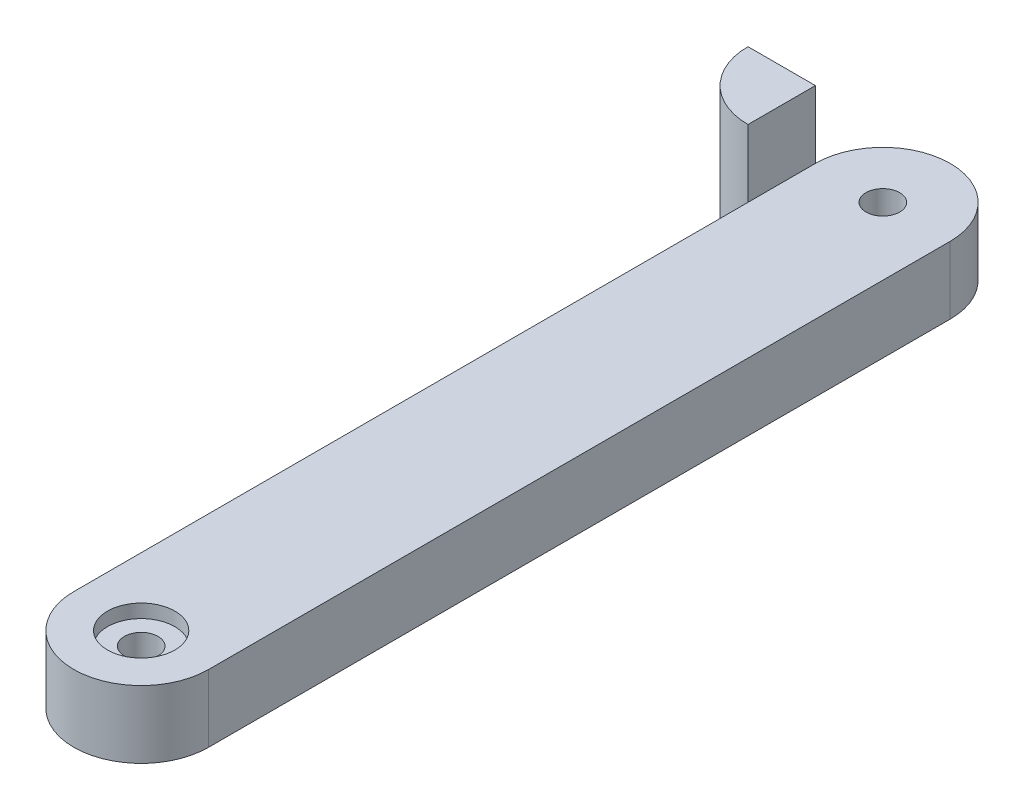
ISO-10303-21;
HEADER;
FILE_DESCRIPTION(('STEP AP214'),'2;1');
FILE_NAME('part.step','',(''),(''),'','','');
FILE_SCHEMA(('AUTOMOTIVE_DESIGN { 1 0 10303 214 1 1 1 1 }'));
ENDSEC;
DATA;
#1=APPLICATION_CONTEXT('core data for automotive mechanical design processes');
#2=APPLICATION_PROTOCOL_DEFINITION('international standard','automotive_design',2000,#1);
#3=PRODUCT_CONTEXT('',#1,'mechanical');
#4=PRODUCT('Part','Part','',(#3));
#5=PRODUCT_RELATED_PRODUCT_CATEGORY('part','',(#4));
#6=PRODUCT_DEFINITION_FORMATION('','',#4);
#7=PRODUCT_DEFINITION_CONTEXT('part definition',#1,'design');
#8=PRODUCT_DEFINITION('design','',#6,#7);
#9=PRODUCT_DEFINITION_SHAPE('','',#8);
#10=(LENGTH_UNIT() NAMED_UNIT(*) SI_UNIT(.MILLI.,.METRE.));
#11=(NAMED_UNIT(*) PLANE_ANGLE_UNIT() SI_UNIT($,.RADIAN.));
#12=(NAMED_UNIT(*) SI_UNIT($,.STERADIAN.) SOLID_ANGLE_UNIT());
#13=UNCERTAINTY_MEASURE_WITH_UNIT(LENGTH_MEASURE(1.E-05),#10,'distance_accuracy_value','');
#14=(GEOMETRIC_REPRESENTATION_CONTEXT(3) GLOBAL_UNCERTAINTY_ASSIGNED_CONTEXT((#13)) GLOBAL_UNIT_ASSIGNED_CONTEXT((#10,
#11,#12)) REPRESENTATION_CONTEXT('',''));
#15=CARTESIAN_POINT('',(0.,0.,0.));
#16=DIRECTION('',(0.,0.,1.));
#17=DIRECTION('',(1.,0.,0.));
#18=AXIS2_PLACEMENT_3D('',#15,#16,#17);
#19=CARTESIAN_POINT('',(0.,0.,-110.));
#20=DIRECTION('',(0.,1.,0.));
#21=DIRECTION('',(0.,0.,1.));
#22=AXIS2_PLACEMENT_3D('',#19,#20,#21);
#23=CYLINDRICAL_SURFACE('',#22,2.5);
#24=CARTESIAN_POINT('',(0.,10.,-110.));
#25=DIRECTION('',(0.,1.,0.));
#26=DIRECTION('',(0.,0.,1.));
#27=AXIS2_PLACEMENT_3D('',#24,#25,#26);
#28=CIRCLE('',#27,2.5);
#29=CARTESIAN_POINT('',(0.,10.,-107.5));
#30=VERTEX_POINT('',#29);
#31=EDGE_CURVE('E143',#30,#30,#28,.T.);
#32=ORIENTED_EDGE('',*,*,#31,.T.);
#33=EDGE_LOOP('',(#32));
#34=FACE_BOUND('',#33,.T.);
#35=CARTESIAN_POINT('',(0.,2.,-110.));
#36=DIRECTION('',(0.,-1.,0.));
#37=DIRECTION('',(0.,0.,-1.));
#38=AXIS2_PLACEMENT_3D('',#35,#36,#37);
#39=CIRCLE('',#38,2.5);
#40=CARTESIAN_POINT('',(0.,2.,-112.5));
#41=VERTEX_POINT('',#40);
#42=EDGE_CURVE('E39',#41,#41,#39,.F.);
#43=ORIENTED_EDGE('',*,*,#42,.F.);
#44=EDGE_LOOP('',(#43));
#45=FACE_BOUND('',#44,.T.);
#46=ADVANCED_FACE('F35',(#34,#45),#23,.F.);
#47=CARTESIAN_POINT('',(0.,0.,0.));
#48=DIRECTION('',(0.,1.,0.));
#49=DIRECTION('',(0.,0.,1.));
#50=AXIS2_PLACEMENT_3D('',#47,#48,#49);
#51=CYLINDRICAL_SURFACE('',#50,2.5);
#52=CARTESIAN_POINT('',(0.,0.,0.));
#53=DIRECTION('',(0.,1.,0.));
#54=DIRECTION('',(0.,0.,1.));
#55=AXIS2_PLACEMENT_3D('',#52,#53,#54);
#56=CIRCLE('',#55,2.5);
#57=CARTESIAN_POINT('',(0.,0.,2.5));
#58=VERTEX_POINT('',#57);
#59=EDGE_CURVE('E144',#58,#58,#56,.T.);
#60=ORIENTED_EDGE('',*,*,#59,.F.);
#61=EDGE_LOOP('',(#60));
#62=FACE_BOUND('',#61,.T.);
#63=CARTESIAN_POINT('',(0.,8.,0.));
#64=DIRECTION('',(0.,1.,0.));
#65=DIRECTION('',(0.,0.,1.));
#66=AXIS2_PLACEMENT_3D('',#63,#64,#65);
#67=CIRCLE('',#66,2.5);
#68=CARTESIAN_POINT('',(0.,8.,2.5));
#69=VERTEX_POINT('',#68);
#70=EDGE_CURVE('E115',#69,#69,#67,.F.);
#71=ORIENTED_EDGE('',*,*,#70,.F.);
#72=EDGE_LOOP('',(#71));
#73=FACE_BOUND('',#72,.T.);
#74=ADVANCED_FACE('F193',(#62,#73),#51,.F.);
#75=CARTESIAN_POINT('',(0.,10.,0.));
#76=DIRECTION('',(0.,1.,0.));
#77=DIRECTION('',(0.,0.,1.));
#78=AXIS2_PLACEMENT_3D('',#75,#76,#77);
#79=PLANE('',#78);
#80=CARTESIAN_POINT('',(0.,10.,0.));
#81=DIRECTION('',(0.,1.,0.));
#82=DIRECTION('',(0.,0.,1.));
#83=AXIS2_PLACEMENT_3D('',#80,#81,#82);
#84=CIRCLE('',#83,5.);
#85=CARTESIAN_POINT('',(0.,10.,5.));
#86=VERTEX_POINT('',#85);
#87=EDGE_CURVE('E173',#86,#86,#84,.T.);
#88=ORIENTED_EDGE('',*,*,#87,.F.);
#89=EDGE_LOOP('',(#88));
#90=FACE_BOUND('',#89,.T.);
#91=DIRECTION('',(0.,0.,-1.));
#92=VECTOR('',#91,1.);
#93=CARTESIAN_POINT('',(-9.99999999999999,10.,-110.));
#94=LINE('',#93,#92);
#95=CARTESIAN_POINT('',(-10.,10.,-100.));
#96=VERTEX_POINT('',#95);
#97=CARTESIAN_POINT('',(-9.99999999999999,10.,-110.));
#98=VERTEX_POINT('',#97);
#99=EDGE_CURVE('E114',#96,#98,#94,.T.);
#100=ORIENTED_EDGE('',*,*,#99,.F.);
#101=DIRECTION('',(0.,0.,-1.));
#102=VECTOR('',#101,1.);
#103=CARTESIAN_POINT('',(-10.,10.,0.));
#104=LINE('',#103,#102);
#105=CARTESIAN_POINT('',(-10.,10.,0.));
#106=VERTEX_POINT('',#105);
#107=EDGE_CURVE('E152',#106,#96,#104,.T.);
#108=ORIENTED_EDGE('',*,*,#107,.F.);
#109=CARTESIAN_POINT('',(0.,10.,0.));
#110=DIRECTION('',(0.,1.,0.));
#111=DIRECTION('',(0.,0.,1.));
#112=AXIS2_PLACEMENT_3D('',#109,#110,#111);
#113=CIRCLE('',#112,10.);
#114=CARTESIAN_POINT('',(10.,10.,0.));
#115=VERTEX_POINT('',#114);
#116=EDGE_CURVE('E154',#106,#115,#113,.T.);
#117=ORIENTED_EDGE('',*,*,#116,.T.);
#118=DIRECTION('',(0.,0.,-1.));
#119=VECTOR('',#118,1.);
#120=CARTESIAN_POINT('',(10.,10.,0.));
#121=LINE('',#120,#119);
#122=CARTESIAN_POINT('',(10.,10.,-110.));
#123=VERTEX_POINT('',#122);
#124=EDGE_CURVE('E54',#115,#123,#121,.T.);
#125=ORIENTED_EDGE('',*,*,#124,.T.);
#126=CARTESIAN_POINT('',(0.,10.,-110.));
#127=DIRECTION('',(0.,1.,0.));
#128=DIRECTION('',(0.,0.,1.));
#129=AXIS2_PLACEMENT_3D('',#126,#127,#128);
#130=CIRCLE('',#129,10.);
#131=EDGE_CURVE('E150',#123,#98,#130,.T.);
#132=ORIENTED_EDGE('',*,*,#131,.T.);
#133=EDGE_LOOP('',(#100,#108,#117,#125,#132));
#134=FACE_BOUND('',#133,.T.);
#135=ORIENTED_EDGE('',*,*,#31,.F.);
#136=EDGE_LOOP('',(#135));
#137=FACE_BOUND('',#136,.T.);
#138=ADVANCED_FACE('F199',(#90,#134,#137),#79,.T.);
#139=CARTESIAN_POINT('',(-10.,10.,0.));
#140=DIRECTION('',(-1.,0.,0.));
#141=DIRECTION('',(0.,0.,1.));
#142=AXIS2_PLACEMENT_3D('',#139,#140,#141);
#143=PLANE('',#142);
#144=ORIENTED_EDGE('',*,*,#107,.T.);
#145=DIRECTION('',(0.,1.,0.));
#146=VECTOR('',#145,1.);
#147=CARTESIAN_POINT('',(-10.,10.,-100.));
#148=LINE('',#147,#146);
#149=CARTESIAN_POINT('',(-10.,0.,-100.));
#150=VERTEX_POINT('',#149);
#151=EDGE_CURVE('E122',#150,#96,#148,.T.);
#152=ORIENTED_EDGE('',*,*,#151,.F.);
#153=DIRECTION('',(0.,0.,-1.));
#154=VECTOR('',#153,1.);
#155=CARTESIAN_POINT('',(-10.,0.,0.));
#156=LINE('',#155,#154);
#157=CARTESIAN_POINT('',(-10.,0.,0.));
#158=VERTEX_POINT('',#157);
#159=EDGE_CURVE('E160',#158,#150,#156,.T.);
#160=ORIENTED_EDGE('',*,*,#159,.F.);
#161=DIRECTION('',(0.,-1.,0.));
#162=VECTOR('',#161,1.);
#163=CARTESIAN_POINT('',(-10.,10.,0.));
#164=LINE('',#163,#162);
#165=EDGE_CURVE('E45',#106,#158,#164,.T.);
#166=ORIENTED_EDGE('',*,*,#165,.F.);
#167=EDGE_LOOP('',(#144,#152,#160,#166));
#168=FACE_BOUND('',#167,.T.);
#169=ADVANCED_FACE('F206',(#168),#143,.T.);
#170=CARTESIAN_POINT('',(0.,10.,-110.));
#171=DIRECTION('',(0.,-1.,0.));
#172=DIRECTION('',(0.,0.,-1.));
#173=AXIS2_PLACEMENT_3D('',#170,#171,#172);
#174=CYLINDRICAL_SURFACE('',#173,10.);
#175=CARTESIAN_POINT('',(0.,0.,-110.));
#176=DIRECTION('',(0.,1.,0.));
#177=DIRECTION('',(0.,0.,1.));
#178=AXIS2_PLACEMENT_3D('',#175,#176,#177);
#179=CIRCLE('',#178,10.);
#180=CARTESIAN_POINT('',(10.,0.,-110.));
#181=VERTEX_POINT('',#180);
#182=CARTESIAN_POINT('',(-10.,0.,-110.));
#183=VERTEX_POINT('',#182);
#184=EDGE_CURVE('E147',#181,#183,#179,.T.);
#185=ORIENTED_EDGE('',*,*,#184,.T.);
#186=DIRECTION('',(0.,-1.,0.));
#187=VECTOR('',#186,1.);
#188=CARTESIAN_POINT('',(-10.,10.,-110.));
#189=LINE('',#188,#187);
#190=EDGE_CURVE('E11',#98,#183,#189,.T.);
#191=ORIENTED_EDGE('',*,*,#190,.F.);
#192=ORIENTED_EDGE('',*,*,#131,.F.);
#193=DIRECTION('',(0.,-1.,0.));
#194=VECTOR('',#193,1.);
#195=CARTESIAN_POINT('',(10.,10.,-110.));
#196=LINE('',#195,#194);
#197=EDGE_CURVE('E157',#123,#181,#196,.T.);
#198=ORIENTED_EDGE('',*,*,#197,.T.);
#199=EDGE_LOOP('',(#185,#191,#192,#198));
#200=FACE_BOUND('',#199,.T.);
#201=ADVANCED_FACE('F37',(#200),#174,.T.);
#202=CARTESIAN_POINT('',(0.,10.,0.));
#203=DIRECTION('',(0.,-1.,0.));
#204=DIRECTION('',(0.,0.,-1.));
#205=AXIS2_PLACEMENT_3D('',#202,#203,#204);
#206=CYLINDRICAL_SURFACE('',#205,10.);
#207=CARTESIAN_POINT('',(0.,0.,0.));
#208=DIRECTION('',(0.,1.,0.));
#209=DIRECTION('',(0.,0.,1.));
#210=AXIS2_PLACEMENT_3D('',#207,#208,#209);
#211=CIRCLE('',#210,10.);
#212=CARTESIAN_POINT('',(10.,0.,0.));
#213=VERTEX_POINT('',#212);
#214=EDGE_CURVE('E71',#158,#213,#211,.T.);
#215=ORIENTED_EDGE('',*,*,#214,.T.);
#216=DIRECTION('',(0.,-1.,0.));
#217=VECTOR('',#216,1.);
#218=CARTESIAN_POINT('',(10.,10.,0.));
#219=LINE('',#218,#217);
#220=EDGE_CURVE('E166',#115,#213,#219,.T.);
#221=ORIENTED_EDGE('',*,*,#220,.F.);
#222=ORIENTED_EDGE('',*,*,#116,.F.);
#223=ORIENTED_EDGE('',*,*,#165,.T.);
#224=EDGE_LOOP('',(#215,#221,#222,#223));
#225=FACE_BOUND('',#224,.T.);
#226=ADVANCED_FACE('F215',(#225),#206,.T.);
#227=CARTESIAN_POINT('',(10.,10.,0.));
#228=DIRECTION('',(-1.,0.,0.));
#229=DIRECTION('',(0.,0.,1.));
#230=AXIS2_PLACEMENT_3D('',#227,#228,#229);
#231=PLANE('',#230);
#232=DIRECTION('',(0.,0.,-1.));
#233=VECTOR('',#232,1.);
#234=CARTESIAN_POINT('',(10.,0.,0.));
#235=LINE('',#234,#233);
#236=EDGE_CURVE('E76',#213,#181,#235,.T.);
#237=ORIENTED_EDGE('',*,*,#236,.T.);
#238=ORIENTED_EDGE('',*,*,#197,.F.);
#239=ORIENTED_EDGE('',*,*,#124,.F.);
#240=ORIENTED_EDGE('',*,*,#220,.T.);
#241=EDGE_LOOP('',(#237,#238,#239,#240));
#242=FACE_BOUND('',#241,.T.);
#243=ADVANCED_FACE('F211',(#242),#231,.F.);
#244=CARTESIAN_POINT('',(0.,0.,0.));
#245=DIRECTION('',(0.,1.,0.));
#246=DIRECTION('',(0.,0.,1.));
#247=AXIS2_PLACEMENT_3D('',#244,#245,#246);
#248=PLANE('',#247);
#249=CARTESIAN_POINT('',(0.,0.,-110.));
#250=DIRECTION('',(0.,-1.,0.));
#251=DIRECTION('',(0.,0.,-1.));
#252=AXIS2_PLACEMENT_3D('',#249,#250,#251);
#253=CIRCLE('',#252,5.);
#254=CARTESIAN_POINT('',(0.,0.,-115.));
#255=VERTEX_POINT('',#254);
#256=EDGE_CURVE('E180',#255,#255,#253,.T.);
#257=ORIENTED_EDGE('',*,*,#256,.F.);
#258=EDGE_LOOP('',(#257));
#259=FACE_BOUND('',#258,.T.);
#260=ORIENTED_EDGE('',*,*,#59,.T.);
#261=EDGE_LOOP('',(#260));
#262=FACE_BOUND('',#261,.T.);
#263=ORIENTED_EDGE('',*,*,#184,.F.);
#264=ORIENTED_EDGE('',*,*,#236,.F.);
#265=ORIENTED_EDGE('',*,*,#214,.F.);
#266=ORIENTED_EDGE('',*,*,#159,.T.);
#267=CARTESIAN_POINT('',(-10.,0.,-110.));
#268=DIRECTION('',(0.,1.,0.));
#269=DIRECTION('',(0.,0.,1.));
#270=AXIS2_PLACEMENT_3D('',#267,#268,#269);
#271=CIRCLE('',#270,9.99999999999999);
#272=CARTESIAN_POINT('',(-20.,0.,-110.));
#273=VERTEX_POINT('',#272);
#274=EDGE_CURVE('E141',#273,#150,#271,.T.);
#275=ORIENTED_EDGE('',*,*,#274,.F.);
#276=DIRECTION('',(-1.,0.,0.));
#277=VECTOR('',#276,1.);
#278=CARTESIAN_POINT('',(-9.99999999999999,0.,-110.));
#279=LINE('',#278,#277);
#280=EDGE_CURVE('E136',#183,#273,#279,.T.);
#281=ORIENTED_EDGE('',*,*,#280,.F.);
#282=EDGE_LOOP('',(#263,#264,#265,#266,#275,#281));
#283=FACE_BOUND('',#282,.T.);
#284=ADVANCED_FACE('F208',(#259,#262,#283),#248,.F.);
#285=CARTESIAN_POINT('',(-10.,10.,-110.));
#286=DIRECTION('',(0.,1.,0.));
#287=DIRECTION('',(0.,0.,1.));
#288=AXIS2_PLACEMENT_3D('',#285,#286,#287);
#289=CYLINDRICAL_SURFACE('',#288,9.99999999999999);
#290=ORIENTED_EDGE('',*,*,#151,.T.);
#291=DIRECTION('',(0.,-1.,0.));
#292=VECTOR('',#291,1.);
#293=CARTESIAN_POINT('',(-10.,20.,-100.));
#294=LINE('',#293,#292);
#295=CARTESIAN_POINT('',(-10.000000000001,20.,-100.));
#296=VERTEX_POINT('',#295);
#297=EDGE_CURVE('E119',#296,#96,#294,.T.);
#298=ORIENTED_EDGE('',*,*,#297,.F.);
#299=CARTESIAN_POINT('',(-10.0000000000011,20.,-110.));
#300=DIRECTION('',(0.,1.,0.));
#301=DIRECTION('',(0.,0.,1.));
#302=AXIS2_PLACEMENT_3D('',#299,#300,#301);
#303=CIRCLE('',#302,9.9999999999999);
#304=CARTESIAN_POINT('',(-20.000000000001,20.,-110.));
#305=VERTEX_POINT('',#304);
#306=EDGE_CURVE('E104',#305,#296,#303,.T.);
#307=ORIENTED_EDGE('',*,*,#306,.F.);
#308=DIRECTION('',(0.,1.,0.));
#309=VECTOR('',#308,1.);
#310=CARTESIAN_POINT('',(-20.,10.,-110.));
#311=LINE('',#310,#309);
#312=EDGE_CURVE('E139',#273,#305,#311,.T.);
#313=ORIENTED_EDGE('',*,*,#312,.F.);
#314=ORIENTED_EDGE('',*,*,#274,.T.);
#315=EDGE_LOOP('',(#290,#298,#307,#313,#314));
#316=FACE_BOUND('',#315,.T.);
#317=ADVANCED_FACE('F120',(#316),#289,.T.);
#318=CARTESIAN_POINT('',(-120.,0.,-110.));
#319=DIRECTION('',(0.,0.,-1.));
#320=DIRECTION('',(-1.,0.,0.));
#321=AXIS2_PLACEMENT_3D('',#318,#319,#320);
#322=PLANE('',#321);
#323=ORIENTED_EDGE('',*,*,#312,.T.);
#324=DIRECTION('',(-1.,0.,0.));
#325=VECTOR('',#324,1.);
#326=CARTESIAN_POINT('',(-20.,20.,-110.));
#327=LINE('',#326,#325);
#328=CARTESIAN_POINT('',(-9.99999999999999,20.,-110.));
#329=VERTEX_POINT('',#328);
#330=EDGE_CURVE('E111',#329,#305,#327,.T.);
#331=ORIENTED_EDGE('',*,*,#330,.F.);
#332=DIRECTION('',(0.,-1.,0.));
#333=VECTOR('',#332,1.);
#334=CARTESIAN_POINT('',(-9.99999999999999,20.,-110.));
#335=LINE('',#334,#333);
#336=EDGE_CURVE('E126',#329,#98,#335,.T.);
#337=ORIENTED_EDGE('',*,*,#336,.T.);
#338=ORIENTED_EDGE('',*,*,#190,.T.);
#339=ORIENTED_EDGE('',*,*,#280,.T.);
#340=EDGE_LOOP('',(#323,#331,#337,#338,#339));
#341=FACE_BOUND('',#340,.T.);
#342=ADVANCED_FACE('F227',(#341),#322,.T.);
#343=CARTESIAN_POINT('',(-9.99999999999999,20.,-110.));
#344=DIRECTION('',(-1.,0.,0.));
#345=DIRECTION('',(0.,0.,1.));
#346=AXIS2_PLACEMENT_3D('',#343,#344,#345);
#347=PLANE('',#346);
#348=ORIENTED_EDGE('',*,*,#99,.T.);
#349=ORIENTED_EDGE('',*,*,#336,.F.);
#350=DIRECTION('',(0.,0.,-1.));
#351=VECTOR('',#350,1.);
#352=CARTESIAN_POINT('',(-9.99999999999999,20.,-110.));
#353=LINE('',#352,#351);
#354=EDGE_CURVE('E108',#296,#329,#353,.T.);
#355=ORIENTED_EDGE('',*,*,#354,.F.);
#356=ORIENTED_EDGE('',*,*,#297,.T.);
#357=EDGE_LOOP('',(#348,#349,#355,#356));
#358=FACE_BOUND('',#357,.T.);
#359=ADVANCED_FACE('F128',(#358),#347,.F.);
#360=CARTESIAN_POINT('',(0.,20.,0.));
#361=DIRECTION('',(0.,-1.,0.));
#362=DIRECTION('',(0.,0.,-1.));
#363=AXIS2_PLACEMENT_3D('',#360,#361,#362);
#364=PLANE('',#363);
#365=ORIENTED_EDGE('',*,*,#330,.T.);
#366=ORIENTED_EDGE('',*,*,#306,.T.);
#367=ORIENTED_EDGE('',*,*,#354,.T.);
#368=EDGE_LOOP('',(#365,#366,#367));
#369=FACE_BOUND('',#368,.T.);
#370=ADVANCED_FACE('F106',(#369),#364,.F.);
#371=CARTESIAN_POINT('',(0.,8.,0.));
#372=DIRECTION('',(0.,1.,0.));
#373=DIRECTION('',(0.,0.,1.));
#374=AXIS2_PLACEMENT_3D('',#371,#372,#373);
#375=PLANE('',#374);
#376=CARTESIAN_POINT('',(0.,8.,0.));
#377=DIRECTION('',(0.,1.,0.));
#378=DIRECTION('',(0.,0.,1.));
#379=AXIS2_PLACEMENT_3D('',#376,#377,#378);
#380=CIRCLE('',#379,5.);
#381=CARTESIAN_POINT('',(0.,8.,5.));
#382=VERTEX_POINT('',#381);
#383=EDGE_CURVE('E169',#382,#382,#380,.T.);
#384=ORIENTED_EDGE('',*,*,#383,.T.);
#385=EDGE_LOOP('',(#384));
#386=FACE_BOUND('',#385,.T.);
#387=ORIENTED_EDGE('',*,*,#70,.T.);
#388=EDGE_LOOP('',(#387));
#389=FACE_BOUND('',#388,.T.);
#390=ADVANCED_FACE('F240',(#386,#389),#375,.T.);
#391=CARTESIAN_POINT('',(0.,8.,0.));
#392=DIRECTION('',(0.,1.,0.));
#393=DIRECTION('',(0.,0.,1.));
#394=AXIS2_PLACEMENT_3D('',#391,#392,#393);
#395=CYLINDRICAL_SURFACE('',#394,5.);
#396=ORIENTED_EDGE('',*,*,#383,.F.);
#397=EDGE_LOOP('',(#396));
#398=FACE_BOUND('',#397,.T.);
#399=ORIENTED_EDGE('',*,*,#87,.T.);
#400=EDGE_LOOP('',(#399));
#401=FACE_BOUND('',#400,.T.);
#402=ADVANCED_FACE('F241',(#398,#401),#395,.F.);
#403=CARTESIAN_POINT('',(0.,2.,-110.));
#404=DIRECTION('',(0.,-1.,0.));
#405=DIRECTION('',(0.,0.,-1.));
#406=AXIS2_PLACEMENT_3D('',#403,#404,#405);
#407=PLANE('',#406);
#408=CARTESIAN_POINT('',(0.,2.,-110.));
#409=DIRECTION('',(0.,-1.,0.));
#410=DIRECTION('',(0.,0.,-1.));
#411=AXIS2_PLACEMENT_3D('',#408,#409,#410);
#412=CIRCLE('',#411,5.);
#413=CARTESIAN_POINT('',(0.,2.,-115.));
#414=VERTEX_POINT('',#413);
#415=EDGE_CURVE('E183',#414,#414,#412,.T.);
#416=ORIENTED_EDGE('',*,*,#415,.T.);
#417=EDGE_LOOP('',(#416));
#418=FACE_BOUND('',#417,.T.);
#419=ORIENTED_EDGE('',*,*,#42,.T.);
#420=EDGE_LOOP('',(#419));
#421=FACE_BOUND('',#420,.T.);
#422=ADVANCED_FACE('F190',(#418,#421),#407,.T.);
#423=CARTESIAN_POINT('',(0.,2.,-110.));
#424=DIRECTION('',(0.,-1.,0.));
#425=DIRECTION('',(0.,0.,-1.));
#426=AXIS2_PLACEMENT_3D('',#423,#424,#425);
#427=CYLINDRICAL_SURFACE('',#426,5.);
#428=ORIENTED_EDGE('',*,*,#415,.F.);
#429=EDGE_LOOP('',(#428));
#430=FACE_BOUND('',#429,.T.);
#431=ORIENTED_EDGE('',*,*,#256,.T.);
#432=EDGE_LOOP('',(#431));
#433=FACE_BOUND('',#432,.T.);
#434=ADVANCED_FACE('F247',(#430,#433),#427,.F.);
#435=CLOSED_SHELL('',(#46,#74,#138,#169,#201,#226,#243,#284,#317,#342,#359,#370,#390,#402,#422,#434));
#436=MANIFOLD_SOLID_BREP('B2',#435);
#437=ADVANCED_BREP_SHAPE_REPRESENTATION('',(#18,#436),#14);
#438=SHAPE_DEFINITION_REPRESENTATION(#9,#437);
ENDSEC;
END-ISO-10303-21;
